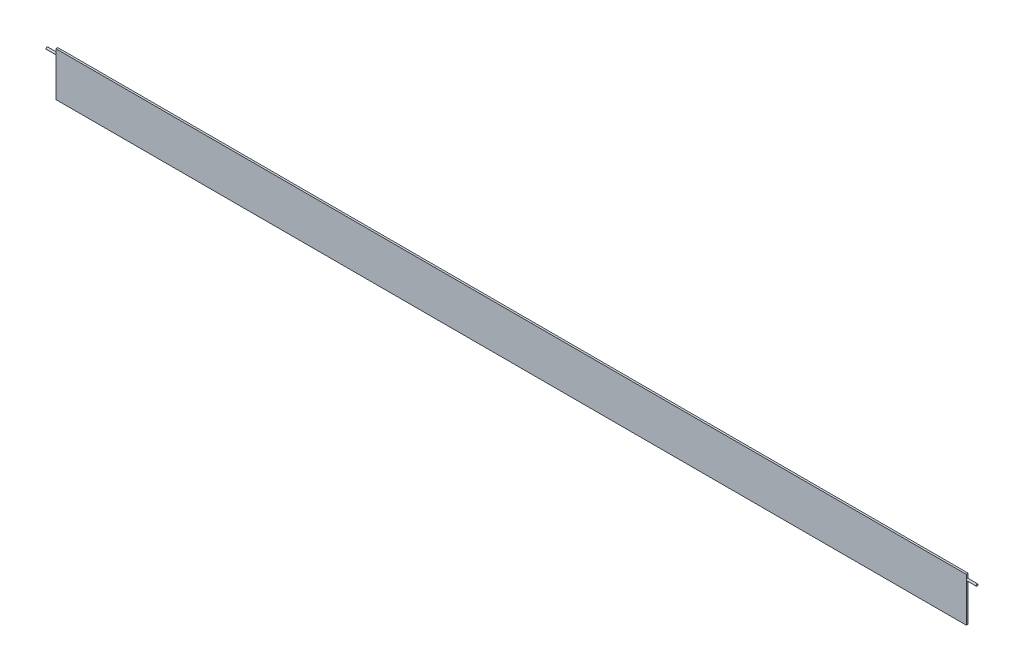
ISO-10303-21;
HEADER;
FILE_DESCRIPTION(('STEP AP214'),'2;1');
FILE_NAME('part.step','',(''),(''),'','','');
FILE_SCHEMA(('AUTOMOTIVE_DESIGN { 1 0 10303 214 1 1 1 1 }'));
ENDSEC;
DATA;
#1=APPLICATION_CONTEXT('core data for automotive mechanical design processes');
#2=APPLICATION_PROTOCOL_DEFINITION('international standard','automotive_design',2000,#1);
#3=PRODUCT_CONTEXT('',#1,'mechanical');
#4=PRODUCT('Part','Part','',(#3));
#5=PRODUCT_RELATED_PRODUCT_CATEGORY('part','',(#4));
#6=PRODUCT_DEFINITION_FORMATION('','',#4);
#7=PRODUCT_DEFINITION_CONTEXT('part definition',#1,'design');
#8=PRODUCT_DEFINITION('design','',#6,#7);
#9=PRODUCT_DEFINITION_SHAPE('','',#8);
#10=(LENGTH_UNIT() NAMED_UNIT(*) SI_UNIT(.MILLI.,.METRE.));
#11=(NAMED_UNIT(*) PLANE_ANGLE_UNIT() SI_UNIT($,.RADIAN.));
#12=(NAMED_UNIT(*) SI_UNIT($,.STERADIAN.) SOLID_ANGLE_UNIT());
#13=UNCERTAINTY_MEASURE_WITH_UNIT(LENGTH_MEASURE(1.E-05),#10,'distance_accuracy_value','');
#14=(GEOMETRIC_REPRESENTATION_CONTEXT(3) GLOBAL_UNCERTAINTY_ASSIGNED_CONTEXT((#13)) GLOBAL_UNIT_ASSIGNED_CONTEXT((#10,
#11,#12)) REPRESENTATION_CONTEXT('',''));
#15=CARTESIAN_POINT('',(0.,0.,0.));
#16=DIRECTION('',(0.,0.,1.));
#17=DIRECTION('',(1.,0.,0.));
#18=AXIS2_PLACEMENT_3D('',#15,#16,#17);
#19=CARTESIAN_POINT('',(-590.55,-28.5750000000001,1.27));
#20=DIRECTION('',(1.,0.,0.));
#21=DIRECTION('',(0.,0.,-1.));
#22=AXIS2_PLACEMENT_3D('',#19,#20,#21);
#23=PLANE('',#22);
#24=DIRECTION('',(0.,-1.,0.));
#25=VECTOR('',#24,1.);
#26=CARTESIAN_POINT('',(-590.55,-28.5750000000001,-1.27));
#27=LINE('',#26,#25);
#28=CARTESIAN_POINT('',(-590.55,28.5749999999999,-1.27));
#29=VERTEX_POINT('',#28);
#30=CARTESIAN_POINT('',(-590.55,22.2249999999999,-1.27));
#31=VERTEX_POINT('',#30);
#32=EDGE_CURVE('E158',#29,#31,#27,.T.);
#33=ORIENTED_EDGE('',*,*,#32,.T.);
#34=CARTESIAN_POINT('',(-590.55,22.2249999999999,0.));
#35=DIRECTION('',(1.,0.,0.));
#36=DIRECTION('',(0.,0.,-1.));
#37=AXIS2_PLACEMENT_3D('',#34,#35,#36);
#38=CIRCLE('',#37,1.27);
#39=CARTESIAN_POINT('',(-590.55,22.2249999999999,1.27));
#40=VERTEX_POINT('',#39);
#41=EDGE_CURVE('E63',#31,#40,#38,.T.);
#42=ORIENTED_EDGE('',*,*,#41,.T.);
#43=DIRECTION('',(0.,-1.,0.));
#44=VECTOR('',#43,1.);
#45=CARTESIAN_POINT('',(-590.55,-28.5750000000001,1.27));
#46=LINE('',#45,#44);
#47=CARTESIAN_POINT('',(-590.55,28.5749999999999,1.27));
#48=VERTEX_POINT('',#47);
#49=EDGE_CURVE('E149',#48,#40,#46,.T.);
#50=ORIENTED_EDGE('',*,*,#49,.F.);
#51=DIRECTION('',(0.,0.,-1.));
#52=VECTOR('',#51,1.);
#53=CARTESIAN_POINT('',(-590.55,28.5749999999999,1.27));
#54=LINE('',#53,#52);
#55=EDGE_CURVE('E132',#48,#29,#54,.T.);
#56=ORIENTED_EDGE('',*,*,#55,.T.);
#57=EDGE_LOOP('',(#33,#42,#50,#56));
#58=FACE_BOUND('',#57,.T.);
#59=ADVANCED_FACE('F41',(#58),#23,.F.);
#60=CARTESIAN_POINT('',(590.55,-28.5749999999999,1.27));
#61=DIRECTION('',(-1.,0.,0.));
#62=DIRECTION('',(0.,0.,1.));
#63=AXIS2_PLACEMENT_3D('',#60,#61,#62);
#64=PLANE('',#63);
#65=DIRECTION('',(0.,1.,0.));
#66=VECTOR('',#65,1.);
#67=CARTESIAN_POINT('',(590.55,-28.5749999999999,1.27));
#68=LINE('',#67,#66);
#69=CARTESIAN_POINT('',(590.55,22.2249999999999,1.27));
#70=VERTEX_POINT('',#69);
#71=CARTESIAN_POINT('',(590.55,28.5750000000001,1.27));
#72=VERTEX_POINT('',#71);
#73=EDGE_CURVE('E107',#70,#72,#68,.T.);
#74=ORIENTED_EDGE('',*,*,#73,.F.);
#75=CARTESIAN_POINT('',(590.55,22.2249999999999,0.));
#76=DIRECTION('',(-1.,0.,0.));
#77=DIRECTION('',(0.,0.,1.));
#78=AXIS2_PLACEMENT_3D('',#75,#76,#77);
#79=CIRCLE('',#78,1.27);
#80=CARTESIAN_POINT('',(590.55,22.2249999999999,-1.27));
#81=VERTEX_POINT('',#80);
#82=EDGE_CURVE('E56',#70,#81,#79,.T.);
#83=ORIENTED_EDGE('',*,*,#82,.T.);
#84=DIRECTION('',(0.,1.,0.));
#85=VECTOR('',#84,1.);
#86=CARTESIAN_POINT('',(590.55,-28.5749999999999,-1.27));
#87=LINE('',#86,#85);
#88=CARTESIAN_POINT('',(590.55,28.5750000000001,-1.27));
#89=VERTEX_POINT('',#88);
#90=EDGE_CURVE('E105',#81,#89,#87,.T.);
#91=ORIENTED_EDGE('',*,*,#90,.T.);
#92=DIRECTION('',(0.,0.,-1.));
#93=VECTOR('',#92,1.);
#94=CARTESIAN_POINT('',(590.55,28.5750000000001,1.27));
#95=LINE('',#94,#93);
#96=EDGE_CURVE('E136',#72,#89,#95,.T.);
#97=ORIENTED_EDGE('',*,*,#96,.F.);
#98=EDGE_LOOP('',(#74,#83,#91,#97));
#99=FACE_BOUND('',#98,.T.);
#100=ADVANCED_FACE('F103',(#99),#64,.F.);
#101=CARTESIAN_POINT('',(-590.55,-28.5750000000001,1.27));
#102=VERTEX_POINT('',#101);
#103=EDGE_CURVE('E127',#40,#102,#46,.T.);
#104=ORIENTED_EDGE('',*,*,#103,.F.);
#105=EDGE_CURVE('E110',#40,#31,#38,.T.);
#106=ORIENTED_EDGE('',*,*,#105,.T.);
#107=CARTESIAN_POINT('',(-590.55,-28.5750000000001,-1.27));
#108=VERTEX_POINT('',#107);
#109=EDGE_CURVE('E161',#31,#108,#27,.T.);
#110=ORIENTED_EDGE('',*,*,#109,.T.);
#111=DIRECTION('',(0.,0.,-1.));
#112=VECTOR('',#111,1.);
#113=CARTESIAN_POINT('',(-590.55,-28.5750000000001,1.27));
#114=LINE('',#113,#112);
#115=EDGE_CURVE('E12',#102,#108,#114,.T.);
#116=ORIENTED_EDGE('',*,*,#115,.F.);
#117=EDGE_LOOP('',(#104,#106,#110,#116));
#118=FACE_BOUND('',#117,.T.);
#119=ADVANCED_FACE('F43',(#118),#23,.F.);
#120=CARTESIAN_POINT('',(590.55,-28.5749999999999,1.27));
#121=DIRECTION('',(0.,1.,0.));
#122=DIRECTION('',(-1.,0.,0.));
#123=AXIS2_PLACEMENT_3D('',#120,#121,#122);
#124=PLANE('',#123);
#125=DIRECTION('',(1.,0.,0.));
#126=VECTOR('',#125,1.);
#127=CARTESIAN_POINT('',(590.55,-28.5749999999999,-1.27));
#128=LINE('',#127,#126);
#129=CARTESIAN_POINT('',(590.55,-28.5749999999999,-1.27));
#130=VERTEX_POINT('',#129);
#131=EDGE_CURVE('E120',#108,#130,#128,.T.);
#132=ORIENTED_EDGE('',*,*,#131,.T.);
#133=DIRECTION('',(0.,0.,-1.));
#134=VECTOR('',#133,1.);
#135=CARTESIAN_POINT('',(590.55,-28.5749999999999,1.27));
#136=LINE('',#135,#134);
#137=CARTESIAN_POINT('',(590.55,-28.5749999999999,1.27));
#138=VERTEX_POINT('',#137);
#139=EDGE_CURVE('E50',#138,#130,#136,.T.);
#140=ORIENTED_EDGE('',*,*,#139,.F.);
#141=DIRECTION('',(1.,0.,0.));
#142=VECTOR('',#141,1.);
#143=CARTESIAN_POINT('',(590.55,-28.5749999999999,1.27));
#144=LINE('',#143,#142);
#145=EDGE_CURVE('E147',#102,#138,#144,.T.);
#146=ORIENTED_EDGE('',*,*,#145,.F.);
#147=ORIENTED_EDGE('',*,*,#115,.T.);
#148=EDGE_LOOP('',(#132,#140,#146,#147));
#149=FACE_BOUND('',#148,.T.);
#150=ADVANCED_FACE('F172',(#149),#124,.F.);
#151=EDGE_CURVE('E116',#130,#81,#87,.T.);
#152=ORIENTED_EDGE('',*,*,#151,.T.);
#153=EDGE_CURVE('E92',#81,#70,#79,.T.);
#154=ORIENTED_EDGE('',*,*,#153,.T.);
#155=EDGE_CURVE('E142',#138,#70,#68,.T.);
#156=ORIENTED_EDGE('',*,*,#155,.F.);
#157=ORIENTED_EDGE('',*,*,#139,.T.);
#158=EDGE_LOOP('',(#152,#154,#156,#157));
#159=FACE_BOUND('',#158,.T.);
#160=ADVANCED_FACE('F123',(#159),#64,.F.);
#161=CARTESIAN_POINT('',(590.55,28.5750000000001,1.27));
#162=DIRECTION('',(0.,-1.,0.));
#163=DIRECTION('',(1.,0.,0.));
#164=AXIS2_PLACEMENT_3D('',#161,#162,#163);
#165=PLANE('',#164);
#166=DIRECTION('',(-1.,0.,0.));
#167=VECTOR('',#166,1.);
#168=CARTESIAN_POINT('',(590.55,28.5750000000001,-1.27));
#169=LINE('',#168,#167);
#170=EDGE_CURVE('E118',#89,#29,#169,.T.);
#171=ORIENTED_EDGE('',*,*,#170,.T.);
#172=ORIENTED_EDGE('',*,*,#55,.F.);
#173=DIRECTION('',(-1.,0.,0.));
#174=VECTOR('',#173,1.);
#175=CARTESIAN_POINT('',(590.55,28.5750000000001,1.27));
#176=LINE('',#175,#174);
#177=EDGE_CURVE('E137',#72,#48,#176,.T.);
#178=ORIENTED_EDGE('',*,*,#177,.F.);
#179=ORIENTED_EDGE('',*,*,#96,.T.);
#180=EDGE_LOOP('',(#171,#172,#178,#179));
#181=FACE_BOUND('',#180,.T.);
#182=ADVANCED_FACE('F177',(#181),#165,.F.);
#183=CARTESIAN_POINT('',(0.,0.,1.27));
#184=DIRECTION('',(0.,0.,1.));
#185=DIRECTION('',(1.,0.,0.));
#186=AXIS2_PLACEMENT_3D('',#183,#184,#185);
#187=PLANE('',#186);
#188=ORIENTED_EDGE('',*,*,#49,.T.);
#189=ORIENTED_EDGE('',*,*,#103,.T.);
#190=ORIENTED_EDGE('',*,*,#145,.T.);
#191=ORIENTED_EDGE('',*,*,#155,.T.);
#192=ORIENTED_EDGE('',*,*,#73,.T.);
#193=ORIENTED_EDGE('',*,*,#177,.T.);
#194=EDGE_LOOP('',(#188,#189,#190,#191,#192,#193));
#195=FACE_BOUND('',#194,.T.);
#196=ADVANCED_FACE('F173',(#195),#187,.T.);
#197=CARTESIAN_POINT('',(0.,0.,-1.27));
#198=DIRECTION('',(0.,0.,1.));
#199=DIRECTION('',(1.,0.,0.));
#200=AXIS2_PLACEMENT_3D('',#197,#198,#199);
#201=PLANE('',#200);
#202=ORIENTED_EDGE('',*,*,#90,.F.);
#203=ORIENTED_EDGE('',*,*,#151,.F.);
#204=ORIENTED_EDGE('',*,*,#131,.F.);
#205=ORIENTED_EDGE('',*,*,#109,.F.);
#206=ORIENTED_EDGE('',*,*,#32,.F.);
#207=ORIENTED_EDGE('',*,*,#170,.F.);
#208=EDGE_LOOP('',(#202,#203,#204,#205,#206,#207));
#209=FACE_BOUND('',#208,.T.);
#210=ADVANCED_FACE('F114',(#209),#201,.F.);
#211=CARTESIAN_POINT('',(603.25,-28.5749999999999,1.27));
#212=DIRECTION('',(-1.,0.,0.));
#213=DIRECTION('',(0.,0.,1.));
#214=AXIS2_PLACEMENT_3D('',#211,#212,#213);
#215=PLANE('',#214);
#216=CARTESIAN_POINT('',(603.25,22.2249999999999,0.));
#217=DIRECTION('',(-1.,0.,0.));
#218=DIRECTION('',(0.,0.,1.));
#219=AXIS2_PLACEMENT_3D('',#216,#217,#218);
#220=CIRCLE('',#219,1.27);
#221=CARTESIAN_POINT('',(603.25,22.2249999999999,1.27));
#222=VERTEX_POINT('',#221);
#223=EDGE_CURVE('E99',#222,#222,#220,.F.);
#224=ORIENTED_EDGE('',*,*,#223,.T.);
#225=EDGE_LOOP('',(#224));
#226=FACE_BOUND('',#225,.T.);
#227=ADVANCED_FACE('F195',(#226),#215,.F.);
#228=CARTESIAN_POINT('',(619.542102448428,22.2249999999999,0.));
#229=DIRECTION('',(-1.,0.,0.));
#230=DIRECTION('',(0.,0.,1.));
#231=AXIS2_PLACEMENT_3D('',#228,#229,#230);
#232=CYLINDRICAL_SURFACE('',#231,1.27);
#233=ORIENTED_EDGE('',*,*,#223,.F.);
#234=EDGE_LOOP('',(#233));
#235=FACE_BOUND('',#234,.T.);
#236=ORIENTED_EDGE('',*,*,#82,.F.);
#237=ORIENTED_EDGE('',*,*,#153,.F.);
#238=EDGE_LOOP('',(#236,#237));
#239=FACE_BOUND('',#238,.T.);
#240=ADVANCED_FACE('F93',(#235,#239),#232,.T.);
#241=CARTESIAN_POINT('',(-603.25,22.2249999999999,0.));
#242=DIRECTION('',(-1.,0.,0.));
#243=DIRECTION('',(0.,0.,1.));
#244=AXIS2_PLACEMENT_3D('',#241,#242,#243);
#245=CIRCLE('',#244,1.27);
#246=CARTESIAN_POINT('',(-603.25,22.2249999999999,1.27));
#247=VERTEX_POINT('',#246);
#248=EDGE_CURVE('E212',#247,#247,#245,.T.);
#249=ORIENTED_EDGE('',*,*,#248,.F.);
#250=EDGE_LOOP('',(#249));
#251=FACE_BOUND('',#250,.T.);
#252=ORIENTED_EDGE('',*,*,#41,.F.);
#253=ORIENTED_EDGE('',*,*,#105,.F.);
#254=EDGE_LOOP('',(#252,#253));
#255=FACE_BOUND('',#254,.T.);
#256=ADVANCED_FACE('F198',(#251,#255),#232,.T.);
#257=CARTESIAN_POINT('',(-603.25,22.2249999999999,0.));
#258=DIRECTION('',(-1.,0.,0.));
#259=DIRECTION('',(0.,0.,1.));
#260=AXIS2_PLACEMENT_3D('',#257,#258,#259);
#261=PLANE('',#260);
#262=ORIENTED_EDGE('',*,*,#248,.T.);
#263=EDGE_LOOP('',(#262));
#264=FACE_BOUND('',#263,.T.);
#265=ADVANCED_FACE('F201',(#264),#261,.T.);
#266=CLOSED_SHELL('',(#59,#100,#119,#150,#160,#182,#196,#210,#227,#240,#256,#265));
#267=MANIFOLD_SOLID_BREP('B2',#266);
#268=ADVANCED_BREP_SHAPE_REPRESENTATION('',(#18,#267),#14);
#269=SHAPE_DEFINITION_REPRESENTATION(#9,#268);
ENDSEC;
END-ISO-10303-21;
